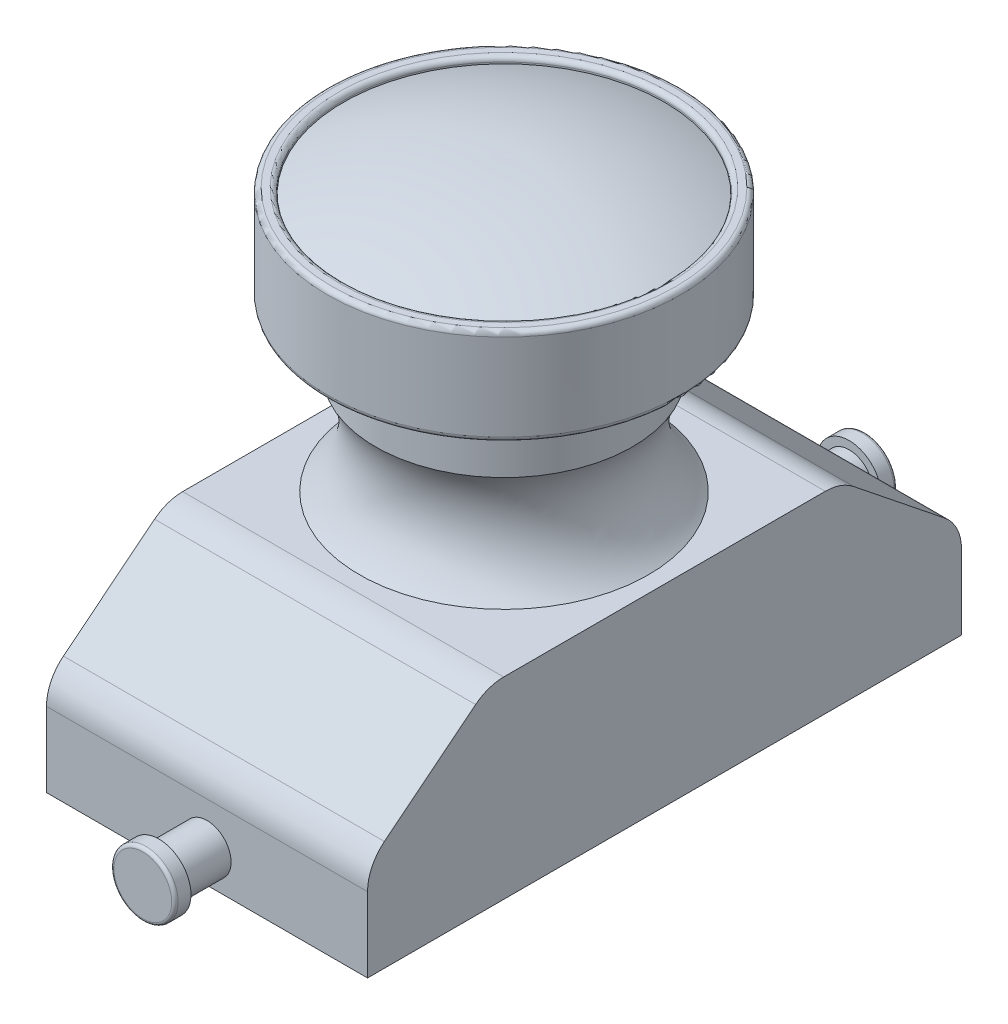
ISO-10303-21;
HEADER;
FILE_DESCRIPTION(('STEP AP214'),'2;1');
FILE_NAME('part.step','',(''),(''),'','','');
FILE_SCHEMA(('AUTOMOTIVE_DESIGN { 1 0 10303 214 1 1 1 1 }'));
ENDSEC;
DATA;
#1=APPLICATION_CONTEXT('core data for automotive mechanical design processes');
#2=APPLICATION_PROTOCOL_DEFINITION('international standard','automotive_design',2000,#1);
#3=PRODUCT_CONTEXT('',#1,'mechanical');
#4=PRODUCT('Part','Part','',(#3));
#5=PRODUCT_RELATED_PRODUCT_CATEGORY('part','',(#4));
#6=PRODUCT_DEFINITION_FORMATION('','',#4);
#7=PRODUCT_DEFINITION_CONTEXT('part definition',#1,'design');
#8=PRODUCT_DEFINITION('design','',#6,#7);
#9=PRODUCT_DEFINITION_SHAPE('','',#8);
#10=(LENGTH_UNIT() NAMED_UNIT(*) SI_UNIT(.MILLI.,.METRE.));
#11=(NAMED_UNIT(*) PLANE_ANGLE_UNIT() SI_UNIT($,.RADIAN.));
#12=(NAMED_UNIT(*) SI_UNIT($,.STERADIAN.) SOLID_ANGLE_UNIT());
#13=UNCERTAINTY_MEASURE_WITH_UNIT(LENGTH_MEASURE(1.E-05),#10,'distance_accuracy_value','');
#14=(GEOMETRIC_REPRESENTATION_CONTEXT(3) GLOBAL_UNCERTAINTY_ASSIGNED_CONTEXT((#13)) GLOBAL_UNIT_ASSIGNED_CONTEXT((#10,
#11,#12)) REPRESENTATION_CONTEXT('',''));
#15=CARTESIAN_POINT('',(0.,0.,0.));
#16=DIRECTION('',(0.,0.,1.));
#17=DIRECTION('',(1.,0.,0.));
#18=AXIS2_PLACEMENT_3D('',#15,#16,#17);
#19=CARTESIAN_POINT('',(0.,1.,-11.25));
#20=DIRECTION('',(0.,0.,1.));
#21=DIRECTION('',(1.,0.,0.));
#22=AXIS2_PLACEMENT_3D('',#19,#20,#21);
#23=CYLINDRICAL_SURFACE('',#22,0.75);
#24=CARTESIAN_POINT('',(0.,1.,-9.25));
#25=DIRECTION('',(0.,0.,1.));
#26=DIRECTION('',(1.,0.,0.));
#27=AXIS2_PLACEMENT_3D('',#24,#25,#26);
#28=CIRCLE('',#27,0.75);
#29=CARTESIAN_POINT('',(0.75,1.,-9.25));
#30=VERTEX_POINT('',#29);
#31=EDGE_CURVE('E289',#30,#30,#28,.F.);
#32=ORIENTED_EDGE('',*,*,#31,.T.);
#33=EDGE_LOOP('',(#32));
#34=FACE_BOUND('',#33,.T.);
#35=CARTESIAN_POINT('',(0.,1.,-10.75));
#36=DIRECTION('',(0.,0.,-1.));
#37=DIRECTION('',(-1.,0.,0.));
#38=AXIS2_PLACEMENT_3D('',#35,#36,#37);
#39=CIRCLE('',#38,0.75);
#40=CARTESIAN_POINT('',(-0.75,1.,-10.75));
#41=VERTEX_POINT('',#40);
#42=EDGE_CURVE('E177',#41,#41,#39,.T.);
#43=ORIENTED_EDGE('',*,*,#42,.F.);
#44=EDGE_LOOP('',(#43));
#45=FACE_BOUND('',#44,.T.);
#46=ADVANCED_FACE('F37',(#34,#45),#23,.T.);
#47=CARTESIAN_POINT('',(0.,1.,11.25));
#48=DIRECTION('',(0.,0.,-1.));
#49=DIRECTION('',(-1.,0.,0.));
#50=AXIS2_PLACEMENT_3D('',#47,#48,#49);
#51=CYLINDRICAL_SURFACE('',#50,0.75);
#52=CARTESIAN_POINT('',(0.,1.,9.25));
#53=DIRECTION('',(0.,0.,-1.));
#54=DIRECTION('',(-1.,0.,0.));
#55=AXIS2_PLACEMENT_3D('',#52,#53,#54);
#56=CIRCLE('',#55,0.75);
#57=CARTESIAN_POINT('',(-0.75,1.,9.25));
#58=VERTEX_POINT('',#57);
#59=EDGE_CURVE('E188',#58,#58,#56,.T.);
#60=ORIENTED_EDGE('',*,*,#59,.F.);
#61=EDGE_LOOP('',(#60));
#62=FACE_BOUND('',#61,.T.);
#63=CARTESIAN_POINT('',(0.,1.,10.75));
#64=DIRECTION('',(0.,0.,1.));
#65=DIRECTION('',(1.,0.,0.));
#66=AXIS2_PLACEMENT_3D('',#63,#64,#65);
#67=CIRCLE('',#66,0.75);
#68=CARTESIAN_POINT('',(0.75,1.,10.75));
#69=VERTEX_POINT('',#68);
#70=EDGE_CURVE('E185',#69,#69,#67,.F.);
#71=ORIENTED_EDGE('',*,*,#70,.T.);
#72=EDGE_LOOP('',(#71));
#73=FACE_BOUND('',#72,.T.);
#74=ADVANCED_FACE('F136',(#62,#73),#51,.T.);
#75=CARTESIAN_POINT('',(5.,3.,-9.25));
#76=DIRECTION('',(0.,0.,1.));
#77=DIRECTION('',(1.,0.,0.));
#78=AXIS2_PLACEMENT_3D('',#75,#76,#77);
#79=PLANE('',#78);
#80=ORIENTED_EDGE('',*,*,#31,.F.);
#81=EDGE_LOOP('',(#80));
#82=FACE_BOUND('',#81,.T.);
#83=DIRECTION('',(0.,1.,0.));
#84=VECTOR('',#83,1.);
#85=CARTESIAN_POINT('',(-5.,3.,-9.25));
#86=LINE('',#85,#84);
#87=CARTESIAN_POINT('',(-5.,0.,-9.25));
#88=VERTEX_POINT('',#87);
#89=CARTESIAN_POINT('',(-5.,2.3271252135188,-9.25));
#90=VERTEX_POINT('',#89);
#91=EDGE_CURVE('E202',#88,#90,#86,.T.);
#92=ORIENTED_EDGE('',*,*,#91,.T.);
#93=DIRECTION('',(-1.,0.,0.));
#94=VECTOR('',#93,1.);
#95=CARTESIAN_POINT('',(5.,2.3271252135188,-9.25));
#96=LINE('',#95,#94);
#97=CARTESIAN_POINT('',(5.,2.3271252135188,-9.25));
#98=VERTEX_POINT('',#97);
#99=EDGE_CURVE('E287',#90,#98,#96,.F.);
#100=ORIENTED_EDGE('',*,*,#99,.T.);
#101=DIRECTION('',(0.,1.,0.));
#102=VECTOR('',#101,1.);
#103=CARTESIAN_POINT('',(5.,3.,-9.25));
#104=LINE('',#103,#102);
#105=CARTESIAN_POINT('',(5.,0.,-9.25));
#106=VERTEX_POINT('',#105);
#107=EDGE_CURVE('E203',#106,#98,#104,.T.);
#108=ORIENTED_EDGE('',*,*,#107,.F.);
#109=DIRECTION('',(-1.,0.,0.));
#110=VECTOR('',#109,1.);
#111=CARTESIAN_POINT('',(5.,0.,-9.25));
#112=LINE('',#111,#110);
#113=EDGE_CURVE('E218',#106,#88,#112,.T.);
#114=ORIENTED_EDGE('',*,*,#113,.T.);
#115=EDGE_LOOP('',(#92,#100,#108,#114));
#116=FACE_BOUND('',#115,.T.);
#117=ADVANCED_FACE('F141',(#82,#116),#79,.F.);
#118=CARTESIAN_POINT('',(5.,3.,-9.25));
#119=DIRECTION('',(0.,-0.78086880944303,0.624695047554424));
#120=DIRECTION('',(0.,-0.624695047554424,-0.78086880944303));
#121=AXIS2_PLACEMENT_3D('',#118,#119,#120);
#122=PLANE('',#121);
#123=DIRECTION('',(0.,0.624695047554424,0.78086880944303));
#124=VECTOR('',#123,1.);
#125=CARTESIAN_POINT('',(5.,3.,-9.25));
#126=LINE('',#125,#124);
#127=CARTESIAN_POINT('',(5.,3.42034154673905,-8.72457306657619));
#128=VERTEX_POINT('',#127);
#129=CARTESIAN_POINT('',(5.,5.69321633322024,-5.8834795834747));
#130=VERTEX_POINT('',#129);
#131=EDGE_CURVE('E206',#128,#130,#126,.T.);
#132=ORIENTED_EDGE('',*,*,#131,.F.);
#133=DIRECTION('',(-1.,0.,0.));
#134=VECTOR('',#133,1.);
#135=CARTESIAN_POINT('',(5.,3.42034154673905,-8.72457306657619));
#136=LINE('',#135,#134);
#137=CARTESIAN_POINT('',(-5.,3.42034154673905,-8.72457306657619));
#138=VERTEX_POINT('',#137);
#139=EDGE_CURVE('E284',#128,#138,#136,.T.);
#140=ORIENTED_EDGE('',*,*,#139,.T.);
#141=DIRECTION('',(0.,0.624695047554424,0.78086880944303));
#142=VECTOR('',#141,1.);
#143=CARTESIAN_POINT('',(-5.,3.,-9.25));
#144=LINE('',#143,#142);
#145=CARTESIAN_POINT('',(-5.,5.69321633322024,-5.8834795834747));
#146=VERTEX_POINT('',#145);
#147=EDGE_CURVE('E221',#138,#146,#144,.T.);
#148=ORIENTED_EDGE('',*,*,#147,.T.);
#149=DIRECTION('',(-1.,0.,0.));
#150=VECTOR('',#149,1.);
#151=CARTESIAN_POINT('',(5.,5.69321633322024,-5.8834795834747));
#152=LINE('',#151,#150);
#153=EDGE_CURVE('E282',#146,#130,#152,.F.);
#154=ORIENTED_EDGE('',*,*,#153,.T.);
#155=EDGE_LOOP('',(#132,#140,#148,#154));
#156=FACE_BOUND('',#155,.T.);
#157=ADVANCED_FACE('F385',(#156),#122,.F.);
#158=CARTESIAN_POINT('',(5.,6.,5.5));
#159=DIRECTION('',(0.,-1.,0.));
#160=DIRECTION('',(0.,0.,-1.));
#161=AXIS2_PLACEMENT_3D('',#158,#159,#160);
#162=PLANE('',#161);
#163=CARTESIAN_POINT('',(0.,6.,0.));
#164=DIRECTION('',(0.,-1.,0.));
#165=DIRECTION('',(0.,0.,-1.));
#166=AXIS2_PLACEMENT_3D('',#163,#164,#165);
#167=CIRCLE('',#166,4.5);
#168=CARTESIAN_POINT('',(0.,6.,-4.5));
#169=VERTEX_POINT('',#168);
#170=EDGE_CURVE('E199',#169,#169,#167,.T.);
#171=ORIENTED_EDGE('',*,*,#170,.T.);
#172=EDGE_LOOP('',(#171));
#173=FACE_BOUND('',#172,.T.);
#174=DIRECTION('',(0.,0.,1.));
#175=VECTOR('',#174,1.);
#176=CARTESIAN_POINT('',(-5.,6.,5.5));
#177=LINE('',#176,#175);
#178=CARTESIAN_POINT('',(-5.,6.,-5.0089065168985));
#179=VERTEX_POINT('',#178);
#180=CARTESIAN_POINT('',(-5.,6.,5.0089065168985));
#181=VERTEX_POINT('',#180);
#182=EDGE_CURVE('E224',#179,#181,#177,.T.);
#183=ORIENTED_EDGE('',*,*,#182,.T.);
#184=DIRECTION('',(-1.,0.,0.));
#185=VECTOR('',#184,1.);
#186=CARTESIAN_POINT('',(5.,6.,5.0089065168985));
#187=LINE('',#186,#185);
#188=CARTESIAN_POINT('',(5.,6.,5.0089065168985));
#189=VERTEX_POINT('',#188);
#190=EDGE_CURVE('E52',#181,#189,#187,.F.);
#191=ORIENTED_EDGE('',*,*,#190,.T.);
#192=DIRECTION('',(0.,0.,1.));
#193=VECTOR('',#192,1.);
#194=CARTESIAN_POINT('',(5.,6.,5.5));
#195=LINE('',#194,#193);
#196=CARTESIAN_POINT('',(5.,6.,-5.0089065168985));
#197=VERTEX_POINT('',#196);
#198=EDGE_CURVE('E209',#197,#189,#195,.T.);
#199=ORIENTED_EDGE('',*,*,#198,.F.);
#200=DIRECTION('',(-1.,0.,0.));
#201=VECTOR('',#200,1.);
#202=CARTESIAN_POINT('',(5.,6.,-5.0089065168985));
#203=LINE('',#202,#201);
#204=EDGE_CURVE('E278',#197,#179,#203,.T.);
#205=ORIENTED_EDGE('',*,*,#204,.T.);
#206=EDGE_LOOP('',(#183,#191,#199,#205));
#207=FACE_BOUND('',#206,.T.);
#208=ADVANCED_FACE('F458',(#173,#207),#162,.F.);
#209=CARTESIAN_POINT('',(5.,3.,9.25));
#210=DIRECTION('',(0.,-0.78086880944303,-0.624695047554424));
#211=DIRECTION('',(0.,0.624695047554424,-0.78086880944303));
#212=AXIS2_PLACEMENT_3D('',#209,#210,#211);
#213=PLANE('',#212);
#214=DIRECTION('',(0.,-0.624695047554424,0.78086880944303));
#215=VECTOR('',#214,1.);
#216=CARTESIAN_POINT('',(-5.,3.,9.25));
#217=LINE('',#216,#215);
#218=CARTESIAN_POINT('',(-5.,5.69321633322024,5.8834795834747));
#219=VERTEX_POINT('',#218);
#220=CARTESIAN_POINT('',(-5.,3.42034154673905,8.72457306657619));
#221=VERTEX_POINT('',#220);
#222=EDGE_CURVE('E226',#219,#221,#217,.T.);
#223=ORIENTED_EDGE('',*,*,#222,.T.);
#224=DIRECTION('',(-1.,0.,0.));
#225=VECTOR('',#224,1.);
#226=CARTESIAN_POINT('',(5.,3.42034154673905,8.72457306657619));
#227=LINE('',#226,#225);
#228=CARTESIAN_POINT('',(5.,3.42034154673905,8.72457306657619));
#229=VERTEX_POINT('',#228);
#230=EDGE_CURVE('E269',#221,#229,#227,.F.);
#231=ORIENTED_EDGE('',*,*,#230,.T.);
#232=DIRECTION('',(0.,-0.624695047554424,0.78086880944303));
#233=VECTOR('',#232,1.);
#234=CARTESIAN_POINT('',(5.,3.,9.25));
#235=LINE('',#234,#233);
#236=CARTESIAN_POINT('',(5.,5.69321633322024,5.8834795834747));
#237=VERTEX_POINT('',#236);
#238=EDGE_CURVE('E211',#237,#229,#235,.T.);
#239=ORIENTED_EDGE('',*,*,#238,.F.);
#240=DIRECTION('',(-1.,0.,0.));
#241=VECTOR('',#240,1.);
#242=CARTESIAN_POINT('',(5.,5.69321633322024,5.8834795834747));
#243=LINE('',#242,#241);
#244=EDGE_CURVE('E266',#237,#219,#243,.T.);
#245=ORIENTED_EDGE('',*,*,#244,.T.);
#246=EDGE_LOOP('',(#223,#231,#239,#245));
#247=FACE_BOUND('',#246,.T.);
#248=ADVANCED_FACE('F372',(#247),#213,.F.);
#249=CARTESIAN_POINT('',(5.,3.,9.25));
#250=DIRECTION('',(0.,0.,-1.));
#251=DIRECTION('',(-1.,0.,0.));
#252=AXIS2_PLACEMENT_3D('',#249,#250,#251);
#253=PLANE('',#252);
#254=ORIENTED_EDGE('',*,*,#59,.T.);
#255=EDGE_LOOP('',(#254));
#256=FACE_BOUND('',#255,.T.);
#257=DIRECTION('',(0.,-1.,0.));
#258=VECTOR('',#257,1.);
#259=CARTESIAN_POINT('',(5.,3.,9.25));
#260=LINE('',#259,#258);
#261=CARTESIAN_POINT('',(5.,2.3271252135188,9.25));
#262=VERTEX_POINT('',#261);
#263=CARTESIAN_POINT('',(5.,0.,9.25));
#264=VERTEX_POINT('',#263);
#265=EDGE_CURVE('E214',#262,#264,#260,.T.);
#266=ORIENTED_EDGE('',*,*,#265,.F.);
#267=DIRECTION('',(-1.,0.,0.));
#268=VECTOR('',#267,1.);
#269=CARTESIAN_POINT('',(5.,2.3271252135188,9.25));
#270=LINE('',#269,#268);
#271=CARTESIAN_POINT('',(-5.,2.3271252135188,9.25));
#272=VERTEX_POINT('',#271);
#273=EDGE_CURVE('E255',#262,#272,#270,.T.);
#274=ORIENTED_EDGE('',*,*,#273,.T.);
#275=DIRECTION('',(0.,-1.,0.));
#276=VECTOR('',#275,1.);
#277=CARTESIAN_POINT('',(-5.,3.,9.25));
#278=LINE('',#277,#276);
#279=CARTESIAN_POINT('',(-5.,0.,9.25));
#280=VERTEX_POINT('',#279);
#281=EDGE_CURVE('E229',#272,#280,#278,.T.);
#282=ORIENTED_EDGE('',*,*,#281,.T.);
#283=DIRECTION('',(-1.,0.,0.));
#284=VECTOR('',#283,1.);
#285=CARTESIAN_POINT('',(5.,0.,9.25));
#286=LINE('',#285,#284);
#287=EDGE_CURVE('E234',#264,#280,#286,.T.);
#288=ORIENTED_EDGE('',*,*,#287,.F.);
#289=EDGE_LOOP('',(#266,#274,#282,#288));
#290=FACE_BOUND('',#289,.T.);
#291=ADVANCED_FACE('F366',(#256,#290),#253,.F.);
#292=CARTESIAN_POINT('',(5.,0.,9.25));
#293=DIRECTION('',(0.,1.,0.));
#294=DIRECTION('',(0.,0.,1.));
#295=AXIS2_PLACEMENT_3D('',#292,#293,#294);
#296=PLANE('',#295);
#297=DIRECTION('',(0.,0.,-1.));
#298=VECTOR('',#297,1.);
#299=CARTESIAN_POINT('',(-5.,0.,9.25));
#300=LINE('',#299,#298);
#301=EDGE_CURVE('E207',#280,#88,#300,.T.);
#302=ORIENTED_EDGE('',*,*,#301,.T.);
#303=ORIENTED_EDGE('',*,*,#113,.F.);
#304=DIRECTION('',(0.,0.,-1.));
#305=VECTOR('',#304,1.);
#306=CARTESIAN_POINT('',(5.,0.,9.25));
#307=LINE('',#306,#305);
#308=EDGE_CURVE('E216',#264,#106,#307,.T.);
#309=ORIENTED_EDGE('',*,*,#308,.F.);
#310=ORIENTED_EDGE('',*,*,#287,.T.);
#311=EDGE_LOOP('',(#302,#303,#309,#310));
#312=FACE_BOUND('',#311,.T.);
#313=ADVANCED_FACE('F371',(#312),#296,.F.);
#314=CARTESIAN_POINT('',(5.,0.,0.));
#315=DIRECTION('',(1.,0.,0.));
#316=DIRECTION('',(0.,0.,-1.));
#317=AXIS2_PLACEMENT_3D('',#314,#315,#316);
#318=PLANE('',#317);
#319=ORIENTED_EDGE('',*,*,#238,.T.);
#320=CARTESIAN_POINT('',(5.,2.3271252135188,7.85));
#321=DIRECTION('',(1.,0.,0.));
#322=DIRECTION('',(0.,0.,-1.));
#323=AXIS2_PLACEMENT_3D('',#320,#321,#322);
#324=CIRCLE('',#323,1.4);
#325=EDGE_CURVE('E276',#229,#262,#324,.T.);
#326=ORIENTED_EDGE('',*,*,#325,.T.);
#327=ORIENTED_EDGE('',*,*,#265,.T.);
#328=ORIENTED_EDGE('',*,*,#308,.T.);
#329=ORIENTED_EDGE('',*,*,#107,.T.);
#330=CARTESIAN_POINT('',(5.,2.3271252135188,-7.85));
#331=DIRECTION('',(1.,0.,0.));
#332=DIRECTION('',(0.,0.,-1.));
#333=AXIS2_PLACEMENT_3D('',#330,#331,#332);
#334=CIRCLE('',#333,1.4);
#335=EDGE_CURVE('E272',#98,#128,#334,.T.);
#336=ORIENTED_EDGE('',*,*,#335,.T.);
#337=ORIENTED_EDGE('',*,*,#131,.T.);
#338=CARTESIAN_POINT('',(5.,4.6,-5.0089065168985));
#339=DIRECTION('',(1.,0.,0.));
#340=DIRECTION('',(0.,0.,-1.));
#341=AXIS2_PLACEMENT_3D('',#338,#339,#340);
#342=CIRCLE('',#341,1.4);
#343=EDGE_CURVE('E59',#130,#197,#342,.T.);
#344=ORIENTED_EDGE('',*,*,#343,.T.);
#345=ORIENTED_EDGE('',*,*,#198,.T.);
#346=CARTESIAN_POINT('',(5.,4.6,5.0089065168985));
#347=DIRECTION('',(1.,0.,0.));
#348=DIRECTION('',(0.,0.,-1.));
#349=AXIS2_PLACEMENT_3D('',#346,#347,#348);
#350=CIRCLE('',#349,1.4);
#351=EDGE_CURVE('E274',#189,#237,#350,.T.);
#352=ORIENTED_EDGE('',*,*,#351,.T.);
#353=EDGE_LOOP('',(#319,#326,#327,#328,#329,#336,#337,#344,#345,#352));
#354=FACE_BOUND('',#353,.T.);
#355=ADVANCED_FACE('F440',(#354),#318,.T.);
#356=CARTESIAN_POINT('',(-5.,0.,0.));
#357=DIRECTION('',(1.,0.,0.));
#358=DIRECTION('',(0.,0.,-1.));
#359=AXIS2_PLACEMENT_3D('',#356,#357,#358);
#360=PLANE('',#359);
#361=ORIENTED_EDGE('',*,*,#281,.F.);
#362=CARTESIAN_POINT('',(-5.,2.3271252135188,7.85));
#363=DIRECTION('',(1.,0.,0.));
#364=DIRECTION('',(0.,0.,-1.));
#365=AXIS2_PLACEMENT_3D('',#362,#363,#364);
#366=CIRCLE('',#365,1.4);
#367=EDGE_CURVE('E264',#272,#221,#366,.F.);
#368=ORIENTED_EDGE('',*,*,#367,.T.);
#369=ORIENTED_EDGE('',*,*,#222,.F.);
#370=CARTESIAN_POINT('',(-5.,4.6,5.0089065168985));
#371=DIRECTION('',(1.,0.,0.));
#372=DIRECTION('',(0.,0.,-1.));
#373=AXIS2_PLACEMENT_3D('',#370,#371,#372);
#374=CIRCLE('',#373,1.4);
#375=EDGE_CURVE('E262',#219,#181,#374,.F.);
#376=ORIENTED_EDGE('',*,*,#375,.T.);
#377=ORIENTED_EDGE('',*,*,#182,.F.);
#378=CARTESIAN_POINT('',(-5.,4.6,-5.0089065168985));
#379=DIRECTION('',(1.,0.,0.));
#380=DIRECTION('',(0.,0.,-1.));
#381=AXIS2_PLACEMENT_3D('',#378,#379,#380);
#382=CIRCLE('',#381,1.4);
#383=EDGE_CURVE('E258',#179,#146,#382,.F.);
#384=ORIENTED_EDGE('',*,*,#383,.T.);
#385=ORIENTED_EDGE('',*,*,#147,.F.);
#386=CARTESIAN_POINT('',(-5.,2.3271252135188,-7.85));
#387=DIRECTION('',(1.,0.,0.));
#388=DIRECTION('',(0.,0.,-1.));
#389=AXIS2_PLACEMENT_3D('',#386,#387,#388);
#390=CIRCLE('',#389,1.4);
#391=EDGE_CURVE('E260',#138,#90,#390,.F.);
#392=ORIENTED_EDGE('',*,*,#391,.T.);
#393=ORIENTED_EDGE('',*,*,#91,.F.);
#394=ORIENTED_EDGE('',*,*,#301,.F.);
#395=EDGE_LOOP('',(#361,#368,#369,#376,#377,#384,#385,#392,#393,#394));
#396=FACE_BOUND('',#395,.T.);
#397=ADVANCED_FACE('F434',(#396),#360,.F.);
#398=CARTESIAN_POINT('',(0.,7.89402615915736,0.));
#399=DIRECTION('',(0.,-1.,0.));
#400=DIRECTION('',(0.,0.,-1.));
#401=AXIS2_PLACEMENT_3D('',#398,#399,#400);
#402=TOROIDAL_SURFACE('',#401,6.13176741860708,2.5);
#403=CARTESIAN_POINT('',(0.,9.2,0.));
#404=DIRECTION('',(0.,-1.,0.));
#405=DIRECTION('',(0.,0.,-1.));
#406=AXIS2_PLACEMENT_3D('',#403,#404,#405);
#407=CIRCLE('',#406,4.);
#408=CARTESIAN_POINT('',(0.,9.2,-4.));
#409=VERTEX_POINT('',#408);
#410=EDGE_CURVE('E196',#409,#409,#407,.T.);
#411=ORIENTED_EDGE('',*,*,#410,.T.);
#412=EDGE_LOOP('',(#411));
#413=FACE_BOUND('',#412,.T.);
#414=ORIENTED_EDGE('',*,*,#170,.F.);
#415=EDGE_LOOP('',(#414));
#416=FACE_BOUND('',#415,.T.);
#417=ADVANCED_FACE('F439',(#413,#416),#402,.F.);
#418=CARTESIAN_POINT('',(0.,0.,0.));
#419=DIRECTION('',(0.,-1.,0.));
#420=DIRECTION('',(0.,0.,-1.));
#421=AXIS2_PLACEMENT_3D('',#418,#419,#420);
#422=CYLINDRICAL_SURFACE('',#421,4.);
#423=CARTESIAN_POINT('',(0.,11.2,0.));
#424=DIRECTION('',(0.,-1.,0.));
#425=DIRECTION('',(0.,0.,-1.));
#426=AXIS2_PLACEMENT_3D('',#423,#424,#425);
#427=CIRCLE('',#426,4.);
#428=CARTESIAN_POINT('',(0.,11.2,-4.));
#429=VERTEX_POINT('',#428);
#430=EDGE_CURVE('E193',#429,#429,#427,.T.);
#431=ORIENTED_EDGE('',*,*,#430,.T.);
#432=EDGE_LOOP('',(#431));
#433=FACE_BOUND('',#432,.T.);
#434=ORIENTED_EDGE('',*,*,#410,.F.);
#435=EDGE_LOOP('',(#434));
#436=FACE_BOUND('',#435,.T.);
#437=ADVANCED_FACE('F532',(#433,#436),#422,.T.);
#438=CARTESIAN_POINT('',(0.,11.2,-5.5));
#439=DIRECTION('',(0.,-1.,0.));
#440=DIRECTION('',(0.,0.,-1.));
#441=AXIS2_PLACEMENT_3D('',#438,#439,#440);
#442=PLANE('',#441);
#443=CARTESIAN_POINT('',(0.,11.2,0.));
#444=DIRECTION('',(0.,-1.,0.));
#445=DIRECTION('',(0.,0.,-1.));
#446=AXIS2_PLACEMENT_3D('',#443,#444,#445);
#447=CIRCLE('',#446,5.35);
#448=CARTESIAN_POINT('',(0.,11.2,-5.35));
#449=VERTEX_POINT('',#448);
#450=EDGE_CURVE('E246',#449,#449,#447,.T.);
#451=ORIENTED_EDGE('',*,*,#450,.T.);
#452=EDGE_LOOP('',(#451));
#453=FACE_BOUND('',#452,.T.);
#454=ORIENTED_EDGE('',*,*,#430,.F.);
#455=EDGE_LOOP('',(#454));
#456=FACE_BOUND('',#455,.T.);
#457=ADVANCED_FACE('F523',(#453,#456),#442,.T.);
#458=CARTESIAN_POINT('',(0.,0.,0.));
#459=DIRECTION('',(0.,-1.,0.));
#460=DIRECTION('',(0.,0.,-1.));
#461=AXIS2_PLACEMENT_3D('',#458,#459,#460);
#462=CYLINDRICAL_SURFACE('',#461,5.5);
#463=CARTESIAN_POINT('',(0.,11.35,0.));
#464=DIRECTION('',(0.,-1.,0.));
#465=DIRECTION('',(0.,0.,-1.));
#466=AXIS2_PLACEMENT_3D('',#463,#464,#465);
#467=CIRCLE('',#466,5.5);
#468=CARTESIAN_POINT('',(0.,11.35,-5.5));
#469=VERTEX_POINT('',#468);
#470=EDGE_CURVE('E252',#469,#469,#467,.F.);
#471=ORIENTED_EDGE('',*,*,#470,.T.);
#472=EDGE_LOOP('',(#471));
#473=FACE_BOUND('',#472,.T.);
#474=CARTESIAN_POINT('',(0.,14.05,0.));
#475=DIRECTION('',(0.,1.,0.));
#476=DIRECTION('',(0.,0.,1.));
#477=AXIS2_PLACEMENT_3D('',#474,#475,#476);
#478=CIRCLE('',#477,5.5);
#479=CARTESIAN_POINT('',(0.,14.05,5.5));
#480=VERTEX_POINT('',#479);
#481=EDGE_CURVE('E249',#480,#480,#478,.F.);
#482=ORIENTED_EDGE('',*,*,#481,.T.);
#483=EDGE_LOOP('',(#482));
#484=FACE_BOUND('',#483,.T.);
#485=ADVANCED_FACE('F513',(#473,#484),#462,.T.);
#486=CARTESIAN_POINT('',(0.,14.2,-5.));
#487=DIRECTION('',(0.,1.,0.));
#488=DIRECTION('',(0.,0.,1.));
#489=AXIS2_PLACEMENT_3D('',#486,#487,#488);
#490=PLANE('',#489);
#491=CARTESIAN_POINT('',(0.,14.2,0.));
#492=DIRECTION('',(0.,1.,0.));
#493=DIRECTION('',(0.,0.,1.));
#494=AXIS2_PLACEMENT_3D('',#491,#492,#493);
#495=CIRCLE('',#494,5.15);
#496=CARTESIAN_POINT('',(0.,14.2,5.15));
#497=VERTEX_POINT('',#496);
#498=EDGE_CURVE('E240',#497,#497,#495,.F.);
#499=ORIENTED_EDGE('',*,*,#498,.T.);
#500=EDGE_LOOP('',(#499));
#501=FACE_BOUND('',#500,.T.);
#502=CARTESIAN_POINT('',(0.,14.2,0.));
#503=DIRECTION('',(0.,1.,0.));
#504=DIRECTION('',(0.,0.,1.));
#505=AXIS2_PLACEMENT_3D('',#502,#503,#504);
#506=CIRCLE('',#505,5.35);
#507=CARTESIAN_POINT('',(0.,14.2,5.35));
#508=VERTEX_POINT('',#507);
#509=EDGE_CURVE('E237',#508,#508,#506,.T.);
#510=ORIENTED_EDGE('',*,*,#509,.T.);
#511=EDGE_LOOP('',(#510));
#512=FACE_BOUND('',#511,.T.);
#513=ADVANCED_FACE('F130',(#501,#512),#490,.T.);
#514=CARTESIAN_POINT('',(0.,0.,0.));
#515=DIRECTION('',(0.,-1.,0.));
#516=DIRECTION('',(0.,0.,-1.));
#517=AXIS2_PLACEMENT_3D('',#514,#515,#516);
#518=CYLINDRICAL_SURFACE('',#517,5.);
#519=CARTESIAN_POINT('',(0.,14.05,0.));
#520=DIRECTION('',(0.,1.,0.));
#521=DIRECTION('',(0.,0.,1.));
#522=AXIS2_PLACEMENT_3D('',#519,#520,#521);
#523=CIRCLE('',#522,5.);
#524=CARTESIAN_POINT('',(0.,14.05,5.));
#525=VERTEX_POINT('',#524);
#526=EDGE_CURVE('E243',#525,#525,#523,.T.);
#527=ORIENTED_EDGE('',*,*,#526,.T.);
#528=EDGE_LOOP('',(#527));
#529=FACE_BOUND('',#528,.T.);
#530=CARTESIAN_POINT('',(0.,14.,0.));
#531=DIRECTION('',(0.,1.,0.));
#532=DIRECTION('',(0.,0.,1.));
#533=AXIS2_PLACEMENT_3D('',#530,#531,#532);
#534=CIRCLE('',#533,5.);
#535=CARTESIAN_POINT('',(0.,14.,5.));
#536=VERTEX_POINT('',#535);
#537=EDGE_CURVE('E191',#536,#536,#534,.T.);
#538=ORIENTED_EDGE('',*,*,#537,.F.);
#539=EDGE_LOOP('',(#538));
#540=FACE_BOUND('',#539,.T.);
#541=ADVANCED_FACE('F120',(#529,#540),#518,.F.);
#542=CARTESIAN_POINT('',(0.,3.00167236240251,0.200334472480498));
#543=DIRECTION('',(-1.,0.,0.));
#544=DIRECTION('',(0.,0.,1.));
#545=AXIS2_PLACEMENT_3D('',#542,#543,#544);
#546=CIRCLE('',#545,12.);
#547=TRIMMED_CURVE('',#546,(PARAMETER_VALUE(-1.58749164174817)),
(PARAMETER_VALUE(1.58749164174817)),.T.,.PARAMETER.);
#548=CARTESIAN_POINT('',(0.,3.00167236240251,0.));
#549=DIRECTION('',(0.,1.,0.));
#550=AXIS1_PLACEMENT('',#548,#549);
#551=SURFACE_OF_REVOLUTION('',#547,#550);
#552=ORIENTED_EDGE('',*,*,#537,.T.);
#553=EDGE_LOOP('',(#552));
#554=FACE_BOUND('',#553,.T.);
#555=CARTESIAN_POINT('',(0.,15.,0.));
#556=VERTEX_POINT('',#555);
#557=VERTEX_LOOP('',#556);
#558=FACE_BOUND('',#557,.T.);
#559=ADVANCED_FACE('F117',(#554,#558),#551,.T.);
#560=CARTESIAN_POINT('',(0.,14.05,0.));
#561=DIRECTION('',(0.,1.,0.));
#562=DIRECTION('',(0.,0.,1.));
#563=AXIS2_PLACEMENT_3D('',#560,#561,#562);
#564=TOROIDAL_SURFACE('',#563,5.15,0.15);
#565=ORIENTED_EDGE('',*,*,#526,.F.);
#566=EDGE_LOOP('',(#565));
#567=FACE_BOUND('',#566,.T.);
#568=ORIENTED_EDGE('',*,*,#498,.F.);
#569=EDGE_LOOP('',(#568));
#570=FACE_BOUND('',#569,.T.);
#571=ADVANCED_FACE('F119',(#567,#570),#564,.T.);
#572=CARTESIAN_POINT('',(0.,11.35,0.));
#573=DIRECTION('',(0.,-1.,0.));
#574=DIRECTION('',(0.,0.,-1.));
#575=AXIS2_PLACEMENT_3D('',#572,#573,#574);
#576=TOROIDAL_SURFACE('',#575,5.35,0.15);
#577=ORIENTED_EDGE('',*,*,#470,.F.);
#578=EDGE_LOOP('',(#577));
#579=FACE_BOUND('',#578,.T.);
#580=ORIENTED_EDGE('',*,*,#450,.F.);
#581=EDGE_LOOP('',(#580));
#582=FACE_BOUND('',#581,.T.);
#583=ADVANCED_FACE('F127',(#579,#582),#576,.T.);
#584=CARTESIAN_POINT('',(0.,14.05,0.));
#585=DIRECTION('',(0.,1.,0.));
#586=DIRECTION('',(0.,0.,1.));
#587=AXIS2_PLACEMENT_3D('',#584,#585,#586);
#588=TOROIDAL_SURFACE('',#587,5.35,0.15);
#589=ORIENTED_EDGE('',*,*,#509,.F.);
#590=EDGE_LOOP('',(#589));
#591=FACE_BOUND('',#590,.T.);
#592=ORIENTED_EDGE('',*,*,#481,.F.);
#593=EDGE_LOOP('',(#592));
#594=FACE_BOUND('',#593,.T.);
#595=ADVANCED_FACE('F426',(#591,#594),#588,.T.);
#596=CARTESIAN_POINT('',(5.,2.3271252135188,7.85));
#597=DIRECTION('',(-1.,0.,0.));
#598=DIRECTION('',(0.,0.,1.));
#599=AXIS2_PLACEMENT_3D('',#596,#597,#598);
#600=CYLINDRICAL_SURFACE('',#599,1.4);
#601=ORIENTED_EDGE('',*,*,#325,.F.);
#602=ORIENTED_EDGE('',*,*,#230,.F.);
#603=ORIENTED_EDGE('',*,*,#367,.F.);
#604=ORIENTED_EDGE('',*,*,#273,.F.);
#605=EDGE_LOOP('',(#601,#602,#603,#604));
#606=FACE_BOUND('',#605,.T.);
#607=ADVANCED_FACE('F416',(#606),#600,.T.);
#608=CARTESIAN_POINT('',(5.,4.6,5.0089065168985));
#609=DIRECTION('',(-1.,0.,0.));
#610=DIRECTION('',(0.,0.,1.));
#611=AXIS2_PLACEMENT_3D('',#608,#609,#610);
#612=CYLINDRICAL_SURFACE('',#611,1.4);
#613=ORIENTED_EDGE('',*,*,#351,.F.);
#614=ORIENTED_EDGE('',*,*,#190,.F.);
#615=ORIENTED_EDGE('',*,*,#375,.F.);
#616=ORIENTED_EDGE('',*,*,#244,.F.);
#617=EDGE_LOOP('',(#613,#614,#615,#616));
#618=FACE_BOUND('',#617,.T.);
#619=ADVANCED_FACE('F406',(#618),#612,.T.);
#620=CARTESIAN_POINT('',(5.,2.3271252135188,-7.85));
#621=DIRECTION('',(-1.,0.,0.));
#622=DIRECTION('',(0.,0.,1.));
#623=AXIS2_PLACEMENT_3D('',#620,#621,#622);
#624=CYLINDRICAL_SURFACE('',#623,1.4);
#625=ORIENTED_EDGE('',*,*,#335,.F.);
#626=ORIENTED_EDGE('',*,*,#99,.F.);
#627=ORIENTED_EDGE('',*,*,#391,.F.);
#628=ORIENTED_EDGE('',*,*,#139,.F.);
#629=EDGE_LOOP('',(#625,#626,#627,#628));
#630=FACE_BOUND('',#629,.T.);
#631=ADVANCED_FACE('F396',(#630),#624,.T.);
#632=CARTESIAN_POINT('',(5.,4.6,-5.0089065168985));
#633=DIRECTION('',(-1.,0.,0.));
#634=DIRECTION('',(0.,0.,1.));
#635=AXIS2_PLACEMENT_3D('',#632,#633,#634);
#636=CYLINDRICAL_SURFACE('',#635,1.4);
#637=ORIENTED_EDGE('',*,*,#343,.F.);
#638=ORIENTED_EDGE('',*,*,#153,.F.);
#639=ORIENTED_EDGE('',*,*,#383,.F.);
#640=ORIENTED_EDGE('',*,*,#204,.F.);
#641=EDGE_LOOP('',(#637,#638,#639,#640));
#642=FACE_BOUND('',#641,.T.);
#643=ADVANCED_FACE('F161',(#642),#636,.T.);
#644=CARTESIAN_POINT('',(0.,1.,10.75));
#645=DIRECTION('',(0.,0.,1.));
#646=DIRECTION('',(1.,0.,0.));
#647=AXIS2_PLACEMENT_3D('',#644,#645,#646);
#648=CYLINDRICAL_SURFACE('',#647,1.);
#649=CARTESIAN_POINT('',(0.,1.,11.15));
#650=DIRECTION('',(0.,0.,1.));
#651=DIRECTION('',(1.,0.,0.));
#652=AXIS2_PLACEMENT_3D('',#649,#650,#651);
#653=CIRCLE('',#652,1.);
#654=CARTESIAN_POINT('',(1.,1.,11.15));
#655=VERTEX_POINT('',#654);
#656=EDGE_CURVE('E296',#655,#655,#653,.F.);
#657=ORIENTED_EDGE('',*,*,#656,.T.);
#658=EDGE_LOOP('',(#657));
#659=FACE_BOUND('',#658,.T.);
#660=CARTESIAN_POINT('',(0.,1.,10.75));
#661=DIRECTION('',(0.,0.,1.));
#662=DIRECTION('',(1.,0.,0.));
#663=AXIS2_PLACEMENT_3D('',#660,#661,#662);
#664=CIRCLE('',#663,1.);
#665=CARTESIAN_POINT('',(1.,1.,10.75));
#666=VERTEX_POINT('',#665);
#667=EDGE_CURVE('E182',#666,#666,#664,.T.);
#668=ORIENTED_EDGE('',*,*,#667,.T.);
#669=EDGE_LOOP('',(#668));
#670=FACE_BOUND('',#669,.T.);
#671=ADVANCED_FACE('F158',(#659,#670),#648,.T.);
#672=CARTESIAN_POINT('',(0.,1.,10.75));
#673=DIRECTION('',(0.,0.,1.));
#674=DIRECTION('',(1.,0.,0.));
#675=AXIS2_PLACEMENT_3D('',#672,#673,#674);
#676=PLANE('',#675);
#677=ORIENTED_EDGE('',*,*,#70,.F.);
#678=EDGE_LOOP('',(#677));
#679=FACE_BOUND('',#678,.T.);
#680=ORIENTED_EDGE('',*,*,#667,.F.);
#681=EDGE_LOOP('',(#680));
#682=FACE_BOUND('',#681,.T.);
#683=ADVANCED_FACE('F156',(#679,#682),#676,.F.);
#684=CARTESIAN_POINT('',(0.,1.,11.25));
#685=DIRECTION('',(0.,0.,1.));
#686=DIRECTION('',(-1.,0.,0.));
#687=AXIS2_PLACEMENT_3D('',#684,#685,#686);
#688=PLANE('',#687);
#689=CARTESIAN_POINT('',(0.,1.,11.25));
#690=DIRECTION('',(0.,0.,1.));
#691=DIRECTION('',(1.,0.,0.));
#692=AXIS2_PLACEMENT_3D('',#689,#690,#691);
#693=CIRCLE('',#692,0.9);
#694=CARTESIAN_POINT('',(0.9,1.,11.25));
#695=VERTEX_POINT('',#694);
#696=EDGE_CURVE('E291',#695,#695,#693,.T.);
#697=ORIENTED_EDGE('',*,*,#696,.T.);
#698=EDGE_LOOP('',(#697));
#699=FACE_BOUND('',#698,.T.);
#700=ADVANCED_FACE('F152',(#699),#688,.T.);
#701=CARTESIAN_POINT('',(0.,1.,11.15));
#702=DIRECTION('',(0.,0.,1.));
#703=DIRECTION('',(1.,0.,0.));
#704=AXIS2_PLACEMENT_3D('',#701,#702,#703);
#705=TOROIDAL_SURFACE('',#704,0.9,0.1);
#706=ORIENTED_EDGE('',*,*,#656,.F.);
#707=EDGE_LOOP('',(#706));
#708=FACE_BOUND('',#707,.T.);
#709=ORIENTED_EDGE('',*,*,#696,.F.);
#710=EDGE_LOOP('',(#709));
#711=FACE_BOUND('',#710,.T.);
#712=ADVANCED_FACE('F155',(#708,#711),#705,.T.);
#713=CARTESIAN_POINT('',(0.,1.,-10.75));
#714=DIRECTION('',(0.,0.,-1.));
#715=DIRECTION('',(-1.,0.,0.));
#716=AXIS2_PLACEMENT_3D('',#713,#714,#715);
#717=CYLINDRICAL_SURFACE('',#716,1.);
#718=CARTESIAN_POINT('',(0.,1.,-11.15));
#719=DIRECTION('',(0.,0.,-1.));
#720=DIRECTION('',(-1.,0.,0.));
#721=AXIS2_PLACEMENT_3D('',#718,#719,#720);
#722=CIRCLE('',#721,1.);
#723=CARTESIAN_POINT('',(-1.,1.,-11.15));
#724=VERTEX_POINT('',#723);
#725=EDGE_CURVE('E45',#724,#724,#722,.F.);
#726=ORIENTED_EDGE('',*,*,#725,.T.);
#727=EDGE_LOOP('',(#726));
#728=FACE_BOUND('',#727,.T.);
#729=CARTESIAN_POINT('',(0.,1.,-10.75));
#730=DIRECTION('',(0.,0.,1.));
#731=DIRECTION('',(1.,0.,0.));
#732=AXIS2_PLACEMENT_3D('',#729,#730,#731);
#733=CIRCLE('',#732,1.);
#734=CARTESIAN_POINT('',(1.,1.,-10.75));
#735=VERTEX_POINT('',#734);
#736=EDGE_CURVE('E180',#735,#735,#733,.T.);
#737=ORIENTED_EDGE('',*,*,#736,.F.);
#738=EDGE_LOOP('',(#737));
#739=FACE_BOUND('',#738,.T.);
#740=ADVANCED_FACE('F166',(#728,#739),#717,.T.);
#741=CARTESIAN_POINT('',(0.,1.,-10.75));
#742=DIRECTION('',(0.,0.,-1.));
#743=DIRECTION('',(1.,0.,0.));
#744=AXIS2_PLACEMENT_3D('',#741,#742,#743);
#745=PLANE('',#744);
#746=ORIENTED_EDGE('',*,*,#42,.T.);
#747=EDGE_LOOP('',(#746));
#748=FACE_BOUND('',#747,.T.);
#749=ORIENTED_EDGE('',*,*,#736,.T.);
#750=EDGE_LOOP('',(#749));
#751=FACE_BOUND('',#750,.T.);
#752=ADVANCED_FACE('F149',(#748,#751),#745,.F.);
#753=CARTESIAN_POINT('',(0.,1.,-11.25));
#754=DIRECTION('',(0.,0.,-1.));
#755=DIRECTION('',(-1.,0.,0.));
#756=AXIS2_PLACEMENT_3D('',#753,#754,#755);
#757=PLANE('',#756);
#758=CARTESIAN_POINT('',(0.,1.,-11.25));
#759=DIRECTION('',(0.,0.,-1.));
#760=DIRECTION('',(-1.,0.,0.));
#761=AXIS2_PLACEMENT_3D('',#758,#759,#760);
#762=CIRCLE('',#761,0.9);
#763=CARTESIAN_POINT('',(-0.9,1.,-11.25));
#764=VERTEX_POINT('',#763);
#765=EDGE_CURVE('E11',#764,#764,#762,.T.);
#766=ORIENTED_EDGE('',*,*,#765,.T.);
#767=EDGE_LOOP('',(#766));
#768=FACE_BOUND('',#767,.T.);
#769=ADVANCED_FACE('F147',(#768),#757,.T.);
#770=CARTESIAN_POINT('',(0.,1.,-11.15));
#771=DIRECTION('',(0.,0.,-1.));
#772=DIRECTION('',(-1.,0.,0.));
#773=AXIS2_PLACEMENT_3D('',#770,#771,#772);
#774=TOROIDAL_SURFACE('',#773,0.9,0.1);
#775=ORIENTED_EDGE('',*,*,#765,.F.);
#776=EDGE_LOOP('',(#775));
#777=FACE_BOUND('',#776,.T.);
#778=ORIENTED_EDGE('',*,*,#725,.F.);
#779=EDGE_LOOP('',(#778));
#780=FACE_BOUND('',#779,.T.);
#781=ADVANCED_FACE('F39',(#777,#780),#774,.T.);
#782=CLOSED_SHELL('',(#46,#74,#117,#157,#208,#248,#291,#313,#355,#397,#417,#437,#457,#485,#513,
#541,#559,#571,#583,#595,#607,#619,#631,#643,#671,#683,#700,#712,#740,#752,#769,#781));
#783=MANIFOLD_SOLID_BREP('B2',#782);
#784=ADVANCED_BREP_SHAPE_REPRESENTATION('',(#18,#783),#14);
#785=SHAPE_DEFINITION_REPRESENTATION(#9,#784);
ENDSEC;
END-ISO-10303-21;
